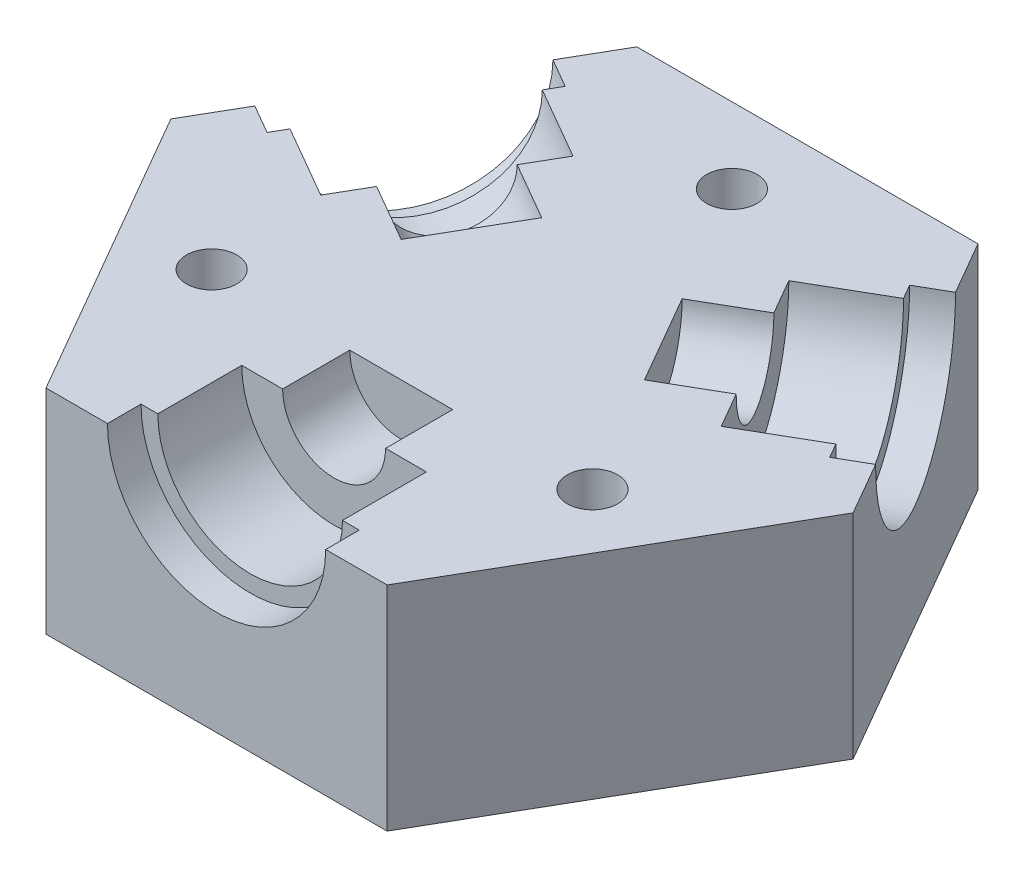
ISO-10303-21;
HEADER;
FILE_DESCRIPTION(('STEP AP214'),'2;1');
FILE_NAME('part.step','',(''),(''),'','','');
FILE_SCHEMA(('AUTOMOTIVE_DESIGN { 1 0 10303 214 1 1 1 1 }'));
ENDSEC;
DATA;
#1=APPLICATION_CONTEXT('core data for automotive mechanical design processes');
#2=APPLICATION_PROTOCOL_DEFINITION('international standard','automotive_design',2000,#1);
#3=PRODUCT_CONTEXT('',#1,'mechanical');
#4=PRODUCT('Part','Part','',(#3));
#5=PRODUCT_RELATED_PRODUCT_CATEGORY('part','',(#4));
#6=PRODUCT_DEFINITION_FORMATION('','',#4);
#7=PRODUCT_DEFINITION_CONTEXT('part definition',#1,'design');
#8=PRODUCT_DEFINITION('design','',#6,#7);
#9=PRODUCT_DEFINITION_SHAPE('','',#8);
#10=(LENGTH_UNIT() NAMED_UNIT(*) SI_UNIT(.MILLI.,.METRE.));
#11=(NAMED_UNIT(*) PLANE_ANGLE_UNIT() SI_UNIT($,.RADIAN.));
#12=(NAMED_UNIT(*) SI_UNIT($,.STERADIAN.) SOLID_ANGLE_UNIT());
#13=UNCERTAINTY_MEASURE_WITH_UNIT(LENGTH_MEASURE(1.E-05),#10,'distance_accuracy_value','');
#14=(GEOMETRIC_REPRESENTATION_CONTEXT(3) GLOBAL_UNCERTAINTY_ASSIGNED_CONTEXT((#13)) GLOBAL_UNIT_ASSIGNED_CONTEXT((#10,
#11,#12)) REPRESENTATION_CONTEXT('',''));
#15=CARTESIAN_POINT('',(0.,0.,0.));
#16=DIRECTION('',(0.,0.,1.));
#17=DIRECTION('',(1.,0.,0.));
#18=AXIS2_PLACEMENT_3D('',#15,#16,#17);
#19=CARTESIAN_POINT('',(0.,12.7,0.));
#20=DIRECTION('',(0.,1.,0.));
#21=DIRECTION('',(0.,0.,1.));
#22=AXIS2_PLACEMENT_3D('',#19,#20,#21);
#23=PLANE('',#22);
#24=CARTESIAN_POINT('',(0.,12.7,-13.0976362048998));
#25=DIRECTION('',(0.,1.,0.));
#26=DIRECTION('',(0.,0.,1.));
#27=AXIS2_PLACEMENT_3D('',#24,#25,#26);
#28=CIRCLE('',#27,1.5);
#29=CARTESIAN_POINT('',(0.,12.7,-11.5976362048998));
#30=VERTEX_POINT('',#29);
#31=EDGE_CURVE('E744',#30,#30,#28,.T.);
#32=ORIENTED_EDGE('',*,*,#31,.F.);
#33=EDGE_LOOP('',(#32));
#34=FACE_BOUND('',#33,.T.);
#35=CARTESIAN_POINT('',(11.3428856829709,12.7,6.54881810245048));
#36=DIRECTION('',(0.,1.,0.));
#37=DIRECTION('',(0.,0.,1.));
#38=AXIS2_PLACEMENT_3D('',#35,#36,#37);
#39=CIRCLE('',#38,1.49999999999968);
#40=CARTESIAN_POINT('',(11.3428856829709,12.7,8.04881810245016));
#41=VERTEX_POINT('',#40);
#42=EDGE_CURVE('E747',#41,#41,#39,.T.);
#43=ORIENTED_EDGE('',*,*,#42,.F.);
#44=EDGE_LOOP('',(#43));
#45=FACE_BOUND('',#44,.T.);
#46=CARTESIAN_POINT('',(-11.3428856829701,12.7,6.54881810245091));
#47=DIRECTION('',(0.,1.,0.));
#48=DIRECTION('',(0.,0.,1.));
#49=AXIS2_PLACEMENT_3D('',#46,#47,#48);
#50=CIRCLE('',#49,1.50000000000075);
#51=CARTESIAN_POINT('',(-11.3428856829701,12.7,8.04881810245166));
#52=VERTEX_POINT('',#51);
#53=EDGE_CURVE('E755',#52,#52,#50,.T.);
#54=ORIENTED_EDGE('',*,*,#53,.F.);
#55=EDGE_LOOP('',(#54));
#56=FACE_BOUND('',#55,.T.);
#57=DIRECTION('',(-0.5,0.,0.866025403784439));
#58=VECTOR('',#57,1.);
#59=CARTESIAN_POINT('',(-10.16,12.7,-17.5976362048998));
#60=LINE('',#59,#58);
#61=CARTESIAN_POINT('',(-10.16,12.7,-17.5976362048998));
#62=VERTEX_POINT('',#61);
#63=CARTESIAN_POINT('',(-11.9900000000001,12.7,-14.4279832270486));
#64=VERTEX_POINT('',#63);
#65=EDGE_CURVE('E220',#62,#64,#60,.T.);
#66=ORIENTED_EDGE('',*,*,#65,.T.);
#67=DIRECTION('',(-0.866025403784443,0.,-0.499999999999992));
#68=VECTOR('',#67,1.);
#69=CARTESIAN_POINT('',(-11.9900000000001,12.7,-14.4279832270486));
#70=LINE('',#69,#68);
#71=CARTESIAN_POINT('',(-10.2579491924312,12.7,-13.4279832270487));
#72=VERTEX_POINT('',#71);
#73=EDGE_CURVE('E54',#64,#72,#70,.F.);
#74=ORIENTED_EDGE('',*,*,#73,.T.);
#75=DIRECTION('',(-0.499999999999992,0.,0.866025403784443));
#76=VECTOR('',#75,1.);
#77=CARTESIAN_POINT('',(-13.5079491924312,12.7,-7.79881810244977));
#78=LINE('',#77,#76);
#79=CARTESIAN_POINT('',(-10.7579491924312,12.7,-12.5619578232642));
#80=VERTEX_POINT('',#79);
#81=EDGE_CURVE('E11',#72,#80,#78,.T.);
#82=ORIENTED_EDGE('',*,*,#81,.T.);
#83=DIRECTION('',(-0.866025403784443,0.,-0.499999999999992));
#84=VECTOR('',#83,1.);
#85=CARTESIAN_POINT('',(-12.4900000000001,12.7,-13.5619578232642));
#86=LINE('',#85,#84);
#87=CARTESIAN_POINT('',(-6.42782217350903,12.7,-10.0619578232642));
#88=VERTEX_POINT('',#87);
#89=EDGE_CURVE('E41',#80,#88,#86,.F.);
#90=ORIENTED_EDGE('',*,*,#89,.T.);
#91=DIRECTION('',(-0.499999999999992,0.,0.866025403784443));
#92=VECTOR('',#91,1.);
#93=CARTESIAN_POINT('',(-9.17782217350898,12.7,-5.29881810244981));
#94=LINE('',#93,#92);
#95=CARTESIAN_POINT('',(-7.64516692295867,12.7,-7.95345486689021));
#96=VERTEX_POINT('',#95);
#97=EDGE_CURVE('E328',#88,#96,#94,.T.);
#98=ORIENTED_EDGE('',*,*,#97,.T.);
#99=DIRECTION('',(-0.866025403784443,0.,-0.499999999999992));
#100=VECTOR('',#99,1.);
#101=CARTESIAN_POINT('',(-13.7073447494498,12.7,-11.4534548668902));
#102=LINE('',#101,#100);
#103=CARTESIAN_POINT('',(-4.1810653078209,12.7,-5.95345486689024));
#104=VERTEX_POINT('',#103);
#105=EDGE_CURVE('E333',#96,#104,#102,.F.);
#106=ORIENTED_EDGE('',*,*,#105,.T.);
#107=DIRECTION('',(-0.499999999999992,0.,0.866025403784443));
#108=VECTOR('',#107,1.);
#109=CARTESIAN_POINT('',(-5.71372055837121,12.7,-3.29881810244984));
#110=LINE('',#109,#108);
#111=CARTESIAN_POINT('',(-7.24637580892152,12.7,-0.644181338009443));
#112=VERTEX_POINT('',#111);
#113=EDGE_CURVE('E331',#104,#112,#110,.T.);
#114=ORIENTED_EDGE('',*,*,#113,.T.);
#115=DIRECTION('',(-0.866025403784443,0.,-0.499999999999992));
#116=VECTOR('',#115,1.);
#117=CARTESIAN_POINT('',(-16.7726552505504,12.7,-6.14418133800936));
#118=LINE('',#117,#116);
#119=CARTESIAN_POINT('',(-10.7104774240593,12.7,-2.64418133800941));
#120=VERTEX_POINT('',#119);
#121=EDGE_CURVE('E327',#112,#120,#118,.T.);
#122=ORIENTED_EDGE('',*,*,#121,.T.);
#123=CARTESIAN_POINT('',(-11.9278221735089,12.7,-0.535678381635376));
#124=VERTEX_POINT('',#123);
#125=EDGE_CURVE('E324',#120,#124,#94,.T.);
#126=ORIENTED_EDGE('',*,*,#125,.T.);
#127=DIRECTION('',(-0.866025403784443,0.,-0.499999999999992));
#128=VECTOR('',#127,1.);
#129=CARTESIAN_POINT('',(-17.99,12.7,-4.03567838163532));
#130=LINE('',#129,#128);
#131=CARTESIAN_POINT('',(-16.2579491924312,12.7,-3.03567838163533));
#132=VERTEX_POINT('',#131);
#133=EDGE_CURVE('E322',#124,#132,#130,.T.);
#134=ORIENTED_EDGE('',*,*,#133,.T.);
#135=CARTESIAN_POINT('',(-16.7579491924311,12.7,-2.16965297785089));
#136=VERTEX_POINT('',#135);
#137=EDGE_CURVE('E47',#132,#136,#78,.T.);
#138=ORIENTED_EDGE('',*,*,#137,.T.);
#139=DIRECTION('',(-0.866025403784443,0.,-0.499999999999992));
#140=VECTOR('',#139,1.);
#141=CARTESIAN_POINT('',(-18.49,12.7,-3.16965297785088));
#142=LINE('',#141,#140);
#143=CARTESIAN_POINT('',(-18.49,12.7,-3.16965297785088));
#144=VERTEX_POINT('',#143);
#145=EDGE_CURVE('E202',#136,#144,#142,.T.);
#146=ORIENTED_EDGE('',*,*,#145,.T.);
#147=CARTESIAN_POINT('',(-20.32,12.7,0.));
#148=VERTEX_POINT('',#147);
#149=EDGE_CURVE('E211',#144,#148,#60,.T.);
#150=ORIENTED_EDGE('',*,*,#149,.T.);
#151=DIRECTION('',(0.5,0.,0.866025403784439));
#152=VECTOR('',#151,1.);
#153=CARTESIAN_POINT('',(-20.32,12.7,0.));
#154=LINE('',#153,#152);
#155=CARTESIAN_POINT('',(-10.16,12.7,17.5976362048998));
#156=VERTEX_POINT('',#155);
#157=EDGE_CURVE('E223',#148,#156,#154,.T.);
#158=ORIENTED_EDGE('',*,*,#157,.T.);
#159=DIRECTION('',(1.,0.,0.));
#160=VECTOR('',#159,1.);
#161=CARTESIAN_POINT('',(-10.16,12.7,17.5976362048998));
#162=LINE('',#161,#160);
#163=CARTESIAN_POINT('',(-6.5,12.7,17.5976362048998));
#164=VERTEX_POINT('',#163);
#165=EDGE_CURVE('E231',#156,#164,#162,.T.);
#166=ORIENTED_EDGE('',*,*,#165,.T.);
#167=DIRECTION('',(0.,0.,1.));
#168=VECTOR('',#167,1.);
#169=CARTESIAN_POINT('',(-6.5,12.7,17.5976362048998));
#170=LINE('',#169,#168);
#171=CARTESIAN_POINT('',(-6.5,12.7,15.5976362048998));
#172=VERTEX_POINT('',#171);
#173=EDGE_CURVE('E295',#164,#172,#170,.F.);
#174=ORIENTED_EDGE('',*,*,#173,.T.);
#175=DIRECTION('',(1.,0.,0.));
#176=VECTOR('',#175,1.);
#177=CARTESIAN_POINT('',(0.,12.7,15.5976362048998));
#178=LINE('',#177,#176);
#179=CARTESIAN_POINT('',(-5.5,12.7,15.5976362048998));
#180=VERTEX_POINT('',#179);
#181=EDGE_CURVE('E276',#172,#180,#178,.T.);
#182=ORIENTED_EDGE('',*,*,#181,.T.);
#183=DIRECTION('',(0.,0.,1.));
#184=VECTOR('',#183,1.);
#185=CARTESIAN_POINT('',(-5.5,12.7,17.5976362048998));
#186=LINE('',#185,#184);
#187=CARTESIAN_POINT('',(-5.5,12.7,10.5976362048998));
#188=VERTEX_POINT('',#187);
#189=EDGE_CURVE('E292',#180,#188,#186,.F.);
#190=ORIENTED_EDGE('',*,*,#189,.T.);
#191=DIRECTION('',(1.,0.,0.));
#192=VECTOR('',#191,1.);
#193=CARTESIAN_POINT('',(0.,12.7,10.5976362048998));
#194=LINE('',#193,#192);
#195=CARTESIAN_POINT('',(-3.06531050110067,12.7,10.5976362048998));
#196=VERTEX_POINT('',#195);
#197=EDGE_CURVE('E283',#188,#196,#194,.T.);
#198=ORIENTED_EDGE('',*,*,#197,.T.);
#199=DIRECTION('',(0.,0.,1.));
#200=VECTOR('',#199,1.);
#201=CARTESIAN_POINT('',(-3.06531050110067,12.7,17.5976362048998));
#202=LINE('',#201,#200);
#203=CARTESIAN_POINT('',(-3.06531050110067,12.7,6.59763620489979));
#204=VERTEX_POINT('',#203);
#205=EDGE_CURVE('E289',#196,#204,#202,.F.);
#206=ORIENTED_EDGE('',*,*,#205,.T.);
#207=DIRECTION('',(1.,0.,0.));
#208=VECTOR('',#207,1.);
#209=CARTESIAN_POINT('',(0.,12.7,6.59763620489979));
#210=LINE('',#209,#208);
#211=CARTESIAN_POINT('',(3.06531050110067,12.7,6.59763620489979));
#212=VERTEX_POINT('',#211);
#213=EDGE_CURVE('E286',#204,#212,#210,.T.);
#214=ORIENTED_EDGE('',*,*,#213,.T.);
#215=DIRECTION('',(0.,0.,1.));
#216=VECTOR('',#215,1.);
#217=CARTESIAN_POINT('',(3.06531050110067,12.7,17.5976362048998));
#218=LINE('',#217,#216);
#219=CARTESIAN_POINT('',(3.06531050110067,12.7,10.5976362048998));
#220=VERTEX_POINT('',#219);
#221=EDGE_CURVE('E282',#212,#220,#218,.T.);
#222=ORIENTED_EDGE('',*,*,#221,.T.);
#223=CARTESIAN_POINT('',(5.5,12.7,10.5976362048998));
#224=VERTEX_POINT('',#223);
#225=EDGE_CURVE('E279',#220,#224,#194,.T.);
#226=ORIENTED_EDGE('',*,*,#225,.T.);
#227=DIRECTION('',(0.,0.,1.));
#228=VECTOR('',#227,1.);
#229=CARTESIAN_POINT('',(5.5,12.7,17.5976362048998));
#230=LINE('',#229,#228);
#231=CARTESIAN_POINT('',(5.5,12.7,15.5976362048998));
#232=VERTEX_POINT('',#231);
#233=EDGE_CURVE('E275',#224,#232,#230,.T.);
#234=ORIENTED_EDGE('',*,*,#233,.T.);
#235=CARTESIAN_POINT('',(6.5,12.7,15.5976362048998));
#236=VERTEX_POINT('',#235);
#237=EDGE_CURVE('E272',#232,#236,#178,.T.);
#238=ORIENTED_EDGE('',*,*,#237,.T.);
#239=DIRECTION('',(0.,0.,1.));
#240=VECTOR('',#239,1.);
#241=CARTESIAN_POINT('',(6.5,12.7,17.5976362048998));
#242=LINE('',#241,#240);
#243=CARTESIAN_POINT('',(6.5,12.7,17.5976362048998));
#244=VERTEX_POINT('',#243);
#245=EDGE_CURVE('E269',#236,#244,#242,.T.);
#246=ORIENTED_EDGE('',*,*,#245,.T.);
#247=CARTESIAN_POINT('',(10.16,12.7,17.5976362048998));
#248=VERTEX_POINT('',#247);
#249=EDGE_CURVE('E230',#244,#248,#162,.T.);
#250=ORIENTED_EDGE('',*,*,#249,.T.);
#251=DIRECTION('',(0.5,0.,-0.866025403784439));
#252=VECTOR('',#251,1.);
#253=CARTESIAN_POINT('',(10.16,12.7,17.5976362048998));
#254=LINE('',#253,#252);
#255=CARTESIAN_POINT('',(20.32,12.7,0.));
#256=VERTEX_POINT('',#255);
#257=EDGE_CURVE('E234',#248,#256,#254,.T.);
#258=ORIENTED_EDGE('',*,*,#257,.T.);
#259=DIRECTION('',(-0.5,0.,-0.866025403784439));
#260=VECTOR('',#259,1.);
#261=CARTESIAN_POINT('',(20.32,12.7,0.));
#262=LINE('',#261,#260);
#263=CARTESIAN_POINT('',(18.49,12.7,-3.16965297785112));
#264=VERTEX_POINT('',#263);
#265=EDGE_CURVE('E237',#256,#264,#262,.T.);
#266=ORIENTED_EDGE('',*,*,#265,.T.);
#267=DIRECTION('',(0.866025403784436,0.,-0.500000000000004));
#268=VECTOR('',#267,1.);
#269=CARTESIAN_POINT('',(18.49,12.7,-3.16965297785114));
#270=LINE('',#269,#268);
#271=CARTESIAN_POINT('',(16.7579491924311,12.7,-2.16965297785113));
#272=VERTEX_POINT('',#271);
#273=EDGE_CURVE('E62',#264,#272,#270,.F.);
#274=ORIENTED_EDGE('',*,*,#273,.T.);
#275=DIRECTION('',(-0.500000000000004,0.,-0.866025403784436));
#276=VECTOR('',#275,1.);
#277=CARTESIAN_POINT('',(13.5079491924311,12.7,-7.79881810244996));
#278=LINE('',#277,#276);
#279=CARTESIAN_POINT('',(16.2579491924311,12.7,-3.03567838163556));
#280=VERTEX_POINT('',#279);
#281=EDGE_CURVE('E207',#272,#280,#278,.T.);
#282=ORIENTED_EDGE('',*,*,#281,.T.);
#283=DIRECTION('',(0.866025403784436,0.,-0.500000000000004));
#284=VECTOR('',#283,1.);
#285=CARTESIAN_POINT('',(17.99,12.7,-4.03567838163557));
#286=LINE('',#285,#284);
#287=CARTESIAN_POINT('',(11.9278221735089,12.7,-0.535678381635539));
#288=VERTEX_POINT('',#287);
#289=EDGE_CURVE('E319',#280,#288,#286,.F.);
#290=ORIENTED_EDGE('',*,*,#289,.T.);
#291=DIRECTION('',(-0.500000000000004,0.,-0.866025403784436));
#292=VECTOR('',#291,1.);
#293=CARTESIAN_POINT('',(9.17782217350891,12.7,-5.29881810244994));
#294=LINE('',#293,#292);
#295=CARTESIAN_POINT('',(10.7104774240593,12.7,-2.64418133800956));
#296=VERTEX_POINT('',#295);
#297=EDGE_CURVE('E310',#288,#296,#294,.T.);
#298=ORIENTED_EDGE('',*,*,#297,.T.);
#299=DIRECTION('',(0.866025403784436,0.,-0.500000000000004));
#300=VECTOR('',#299,1.);
#301=CARTESIAN_POINT('',(16.7726552505503,12.7,-6.14418133800959));
#302=LINE('',#301,#300);
#303=CARTESIAN_POINT('',(7.24637580892151,12.7,-0.644181338009542));
#304=VERTEX_POINT('',#303);
#305=EDGE_CURVE('E316',#296,#304,#302,.F.);
#306=ORIENTED_EDGE('',*,*,#305,.T.);
#307=DIRECTION('',(-0.500000000000004,0.,-0.866025403784436));
#308=VECTOR('',#307,1.);
#309=CARTESIAN_POINT('',(5.71372055837116,12.7,-3.29881810244992));
#310=LINE('',#309,#308);
#311=CARTESIAN_POINT('',(4.18106530782081,12.7,-5.9534548668903));
#312=VERTEX_POINT('',#311);
#313=EDGE_CURVE('E313',#304,#312,#310,.T.);
#314=ORIENTED_EDGE('',*,*,#313,.T.);
#315=DIRECTION('',(0.866025403784436,0.,-0.500000000000004));
#316=VECTOR('',#315,1.);
#317=CARTESIAN_POINT('',(13.7073447494496,12.7,-11.4534548668904));
#318=LINE('',#317,#316);
#319=CARTESIAN_POINT('',(7.64516692295856,12.7,-7.95345486689032));
#320=VERTEX_POINT('',#319);
#321=EDGE_CURVE('E309',#312,#320,#318,.T.);
#322=ORIENTED_EDGE('',*,*,#321,.T.);
#323=CARTESIAN_POINT('',(6.42782217350889,12.7,-10.0619578232643));
#324=VERTEX_POINT('',#323);
#325=EDGE_CURVE('E306',#320,#324,#294,.T.);
#326=ORIENTED_EDGE('',*,*,#325,.T.);
#327=DIRECTION('',(0.866025403784436,0.,-0.500000000000004));
#328=VECTOR('',#327,1.);
#329=CARTESIAN_POINT('',(12.4899999999999,12.7,-13.5619578232644));
#330=LINE('',#329,#328);
#331=CARTESIAN_POINT('',(10.7579491924311,12.7,-12.5619578232644));
#332=VERTEX_POINT('',#331);
#333=EDGE_CURVE('E303',#324,#332,#330,.T.);
#334=ORIENTED_EDGE('',*,*,#333,.T.);
#335=CARTESIAN_POINT('',(10.2579491924311,12.7,-13.4279832270488));
#336=VERTEX_POINT('',#335);
#337=EDGE_CURVE('E300',#332,#336,#278,.T.);
#338=ORIENTED_EDGE('',*,*,#337,.T.);
#339=DIRECTION('',(0.866025403784436,0.,-0.500000000000004));
#340=VECTOR('',#339,1.);
#341=CARTESIAN_POINT('',(11.9899999999999,12.7,-14.4279832270488));
#342=LINE('',#341,#340);
#343=CARTESIAN_POINT('',(11.9899999999999,12.7,-14.4279832270488));
#344=VERTEX_POINT('',#343);
#345=EDGE_CURVE('E375',#336,#344,#342,.T.);
#346=ORIENTED_EDGE('',*,*,#345,.T.);
#347=CARTESIAN_POINT('',(10.16,12.7,-17.5976362048998));
#348=VERTEX_POINT('',#347);
#349=EDGE_CURVE('E236',#344,#348,#262,.T.);
#350=ORIENTED_EDGE('',*,*,#349,.T.);
#351=DIRECTION('',(-1.,0.,0.));
#352=VECTOR('',#351,1.);
#353=CARTESIAN_POINT('',(10.16,12.7,-17.5976362048998));
#354=LINE('',#353,#352);
#355=EDGE_CURVE('E221',#348,#62,#354,.T.);
#356=ORIENTED_EDGE('',*,*,#355,.T.);
#357=EDGE_LOOP('',(#66,#74,#82,#90,#98,#106,#114,#122,#126,#134,#138,#146,#150,#158,#166,#174,
#182,#190,#198,#206,#214,#222,#226,#234,#238,#246,#250,#258,#266,#274,#282,#290,#298,#306,#314,
#322,#326,#334,#338,#346,#350,#356));
#358=FACE_BOUND('',#357,.T.);
#359=ADVANCED_FACE('F37',(#34,#45,#56,#358),#23,.T.);
#360=CARTESIAN_POINT('',(10.16,12.7,-17.5976362048998));
#361=DIRECTION('',(0.,0.,1.));
#362=DIRECTION('',(1.,0.,0.));
#363=AXIS2_PLACEMENT_3D('',#360,#361,#362);
#364=PLANE('',#363);
#365=DIRECTION('',(-1.,0.,0.));
#366=VECTOR('',#365,1.);
#367=CARTESIAN_POINT('',(10.16,0.,-17.5976362048998));
#368=LINE('',#367,#366);
#369=CARTESIAN_POINT('',(10.16,0.,-17.5976362048998));
#370=VERTEX_POINT('',#369);
#371=CARTESIAN_POINT('',(-10.16,0.,-17.5976362048998));
#372=VERTEX_POINT('',#371);
#373=EDGE_CURVE('E241',#370,#372,#368,.T.);
#374=ORIENTED_EDGE('',*,*,#373,.T.);
#375=DIRECTION('',(0.,-1.,0.));
#376=VECTOR('',#375,1.);
#377=CARTESIAN_POINT('',(-10.16,12.7,-17.5976362048998));
#378=LINE('',#377,#376);
#379=EDGE_CURVE('E266',#62,#372,#378,.T.);
#380=ORIENTED_EDGE('',*,*,#379,.F.);
#381=ORIENTED_EDGE('',*,*,#355,.F.);
#382=DIRECTION('',(0.,-1.,0.));
#383=VECTOR('',#382,1.);
#384=CARTESIAN_POINT('',(10.16,12.7,-17.5976362048998));
#385=LINE('',#384,#383);
#386=EDGE_CURVE('E240',#348,#370,#385,.T.);
#387=ORIENTED_EDGE('',*,*,#386,.T.);
#388=EDGE_LOOP('',(#374,#380,#381,#387));
#389=FACE_BOUND('',#388,.T.);
#390=ADVANCED_FACE('F39',(#389),#364,.F.);
#391=CARTESIAN_POINT('',(-10.16,12.7,-17.5976362048998));
#392=DIRECTION('',(0.866025403784439,0.,0.5));
#393=DIRECTION('',(0.5,0.,-0.866025403784439));
#394=AXIS2_PLACEMENT_3D('',#391,#392,#393);
#395=PLANE('',#394);
#396=CARTESIAN_POINT('',(-15.2400000000001,12.7,-8.79881810244976));
#397=DIRECTION('',(0.866025403784439,0.,0.5));
#398=DIRECTION('',(0.5,0.,-0.866025403784439));
#399=AXIS2_PLACEMENT_3D('',#396,#397,#398);
#400=CIRCLE('',#399,6.5);
#401=EDGE_CURVE('E199',#64,#144,#400,.F.);
#402=ORIENTED_EDGE('',*,*,#401,.F.);
#403=ORIENTED_EDGE('',*,*,#65,.F.);
#404=ORIENTED_EDGE('',*,*,#379,.T.);
#405=DIRECTION('',(-0.5,0.,0.866025403784439));
#406=VECTOR('',#405,1.);
#407=CARTESIAN_POINT('',(-10.16,0.,-17.5976362048998));
#408=LINE('',#407,#406);
#409=CARTESIAN_POINT('',(-20.32,0.,0.));
#410=VERTEX_POINT('',#409);
#411=EDGE_CURVE('E244',#372,#410,#408,.T.);
#412=ORIENTED_EDGE('',*,*,#411,.T.);
#413=DIRECTION('',(0.,-1.,0.));
#414=VECTOR('',#413,1.);
#415=CARTESIAN_POINT('',(-20.32,12.7,0.));
#416=LINE('',#415,#414);
#417=EDGE_CURVE('E218',#148,#410,#416,.T.);
#418=ORIENTED_EDGE('',*,*,#417,.F.);
#419=ORIENTED_EDGE('',*,*,#149,.F.);
#420=EDGE_LOOP('',(#402,#403,#404,#412,#418,#419));
#421=FACE_BOUND('',#420,.T.);
#422=ADVANCED_FACE('F216',(#421),#395,.F.);
#423=CARTESIAN_POINT('',(-20.32,12.7,0.));
#424=DIRECTION('',(0.866025403784439,0.,-0.5));
#425=DIRECTION('',(-0.5,0.,-0.866025403784439));
#426=AXIS2_PLACEMENT_3D('',#423,#424,#425);
#427=PLANE('',#426);
#428=DIRECTION('',(0.5,0.,0.866025403784439));
#429=VECTOR('',#428,1.);
#430=CARTESIAN_POINT('',(-20.32,0.,0.));
#431=LINE('',#430,#429);
#432=CARTESIAN_POINT('',(-10.16,0.,17.5976362048998));
#433=VERTEX_POINT('',#432);
#434=EDGE_CURVE('E247',#410,#433,#431,.T.);
#435=ORIENTED_EDGE('',*,*,#434,.T.);
#436=DIRECTION('',(0.,-1.,0.));
#437=VECTOR('',#436,1.);
#438=CARTESIAN_POINT('',(-10.16,12.7,17.5976362048998));
#439=LINE('',#438,#437);
#440=EDGE_CURVE('E262',#156,#433,#439,.T.);
#441=ORIENTED_EDGE('',*,*,#440,.F.);
#442=ORIENTED_EDGE('',*,*,#157,.F.);
#443=ORIENTED_EDGE('',*,*,#417,.T.);
#444=EDGE_LOOP('',(#435,#441,#442,#443));
#445=FACE_BOUND('',#444,.T.);
#446=ADVANCED_FACE('F476',(#445),#427,.F.);
#447=CARTESIAN_POINT('',(-10.16,12.7,17.5976362048998));
#448=DIRECTION('',(0.,0.,-1.));
#449=DIRECTION('',(-1.,0.,0.));
#450=AXIS2_PLACEMENT_3D('',#447,#448,#449);
#451=PLANE('',#450);
#452=CARTESIAN_POINT('',(0.,12.7,17.5976362048998));
#453=DIRECTION('',(0.,0.,1.));
#454=DIRECTION('',(1.,0.,0.));
#455=AXIS2_PLACEMENT_3D('',#452,#453,#454);
#456=CIRCLE('',#455,6.5);
#457=EDGE_CURVE('E379',#164,#244,#456,.T.);
#458=ORIENTED_EDGE('',*,*,#457,.F.);
#459=ORIENTED_EDGE('',*,*,#165,.F.);
#460=ORIENTED_EDGE('',*,*,#440,.T.);
#461=DIRECTION('',(1.,0.,0.));
#462=VECTOR('',#461,1.);
#463=CARTESIAN_POINT('',(-10.16,0.,17.5976362048998));
#464=LINE('',#463,#462);
#465=CARTESIAN_POINT('',(10.16,0.,17.5976362048998));
#466=VERTEX_POINT('',#465);
#467=EDGE_CURVE('E249',#433,#466,#464,.T.);
#468=ORIENTED_EDGE('',*,*,#467,.T.);
#469=DIRECTION('',(0.,-1.,0.));
#470=VECTOR('',#469,1.);
#471=CARTESIAN_POINT('',(10.16,12.7,17.5976362048998));
#472=LINE('',#471,#470);
#473=EDGE_CURVE('E259',#248,#466,#472,.T.);
#474=ORIENTED_EDGE('',*,*,#473,.F.);
#475=ORIENTED_EDGE('',*,*,#249,.F.);
#476=EDGE_LOOP('',(#458,#459,#460,#468,#474,#475));
#477=FACE_BOUND('',#476,.T.);
#478=ADVANCED_FACE('F416',(#477),#451,.F.);
#479=CARTESIAN_POINT('',(10.16,12.7,17.5976362048998));
#480=DIRECTION('',(-0.866025403784439,0.,-0.5));
#481=DIRECTION('',(-0.5,0.,0.866025403784439));
#482=AXIS2_PLACEMENT_3D('',#479,#480,#481);
#483=PLANE('',#482);
#484=DIRECTION('',(0.5,0.,-0.866025403784439));
#485=VECTOR('',#484,1.);
#486=CARTESIAN_POINT('',(10.16,0.,17.5976362048998));
#487=LINE('',#486,#485);
#488=CARTESIAN_POINT('',(20.32,0.,0.));
#489=VERTEX_POINT('',#488);
#490=EDGE_CURVE('E251',#466,#489,#487,.T.);
#491=ORIENTED_EDGE('',*,*,#490,.T.);
#492=DIRECTION('',(0.,-1.,0.));
#493=VECTOR('',#492,1.);
#494=CARTESIAN_POINT('',(20.32,12.7,0.));
#495=LINE('',#494,#493);
#496=EDGE_CURVE('E256',#256,#489,#495,.T.);
#497=ORIENTED_EDGE('',*,*,#496,.F.);
#498=ORIENTED_EDGE('',*,*,#257,.F.);
#499=ORIENTED_EDGE('',*,*,#473,.T.);
#500=EDGE_LOOP('',(#491,#497,#498,#499));
#501=FACE_BOUND('',#500,.T.);
#502=ADVANCED_FACE('F422',(#501),#483,.F.);
#503=CARTESIAN_POINT('',(20.32,12.7,0.));
#504=DIRECTION('',(-0.866025403784439,0.,0.5));
#505=DIRECTION('',(0.5,0.,0.866025403784439));
#506=AXIS2_PLACEMENT_3D('',#503,#504,#505);
#507=PLANE('',#506);
#508=CARTESIAN_POINT('',(15.24,12.7,-8.79881810244997));
#509=DIRECTION('',(-0.866025403784439,0.,0.5));
#510=DIRECTION('',(0.5,0.,0.866025403784439));
#511=AXIS2_PLACEMENT_3D('',#508,#509,#510);
#512=CIRCLE('',#511,6.5);
#513=EDGE_CURVE('E298',#264,#344,#512,.F.);
#514=ORIENTED_EDGE('',*,*,#513,.F.);
#515=ORIENTED_EDGE('',*,*,#265,.F.);
#516=ORIENTED_EDGE('',*,*,#496,.T.);
#517=DIRECTION('',(-0.5,0.,-0.866025403784439));
#518=VECTOR('',#517,1.);
#519=CARTESIAN_POINT('',(20.32,0.,0.));
#520=LINE('',#519,#518);
#521=EDGE_CURVE('E225',#489,#370,#520,.T.);
#522=ORIENTED_EDGE('',*,*,#521,.T.);
#523=ORIENTED_EDGE('',*,*,#386,.F.);
#524=ORIENTED_EDGE('',*,*,#349,.F.);
#525=EDGE_LOOP('',(#514,#515,#516,#522,#523,#524));
#526=FACE_BOUND('',#525,.T.);
#527=ADVANCED_FACE('F426',(#526),#507,.F.);
#528=CARTESIAN_POINT('',(0.,0.,0.));
#529=DIRECTION('',(0.,1.,0.));
#530=DIRECTION('',(0.,0.,1.));
#531=AXIS2_PLACEMENT_3D('',#528,#529,#530);
#532=PLANE('',#531);
#533=ORIENTED_EDGE('',*,*,#373,.F.);
#534=ORIENTED_EDGE('',*,*,#521,.F.);
#535=ORIENTED_EDGE('',*,*,#490,.F.);
#536=ORIENTED_EDGE('',*,*,#467,.F.);
#537=ORIENTED_EDGE('',*,*,#434,.F.);
#538=ORIENTED_EDGE('',*,*,#411,.F.);
#539=EDGE_LOOP('',(#533,#534,#535,#536,#537,#538));
#540=FACE_BOUND('',#539,.T.);
#541=ADVANCED_FACE('F466',(#540),#532,.F.);
#542=CARTESIAN_POINT('',(0.,12.7,6.59763620489979));
#543=DIRECTION('',(0.,0.,1.));
#544=DIRECTION('',(1.,0.,0.));
#545=AXIS2_PLACEMENT_3D('',#542,#543,#544);
#546=PLANE('',#545);
#547=CARTESIAN_POINT('',(0.,12.7,6.59763620489979));
#548=DIRECTION('',(0.,0.,1.));
#549=DIRECTION('',(1.,0.,0.));
#550=AXIS2_PLACEMENT_3D('',#547,#548,#549);
#551=CIRCLE('',#550,3.06531050110067);
#552=EDGE_CURVE('E245',#204,#212,#551,.T.);
#553=ORIENTED_EDGE('',*,*,#552,.T.);
#554=ORIENTED_EDGE('',*,*,#213,.F.);
#555=EDGE_LOOP('',(#553,#554));
#556=FACE_BOUND('',#555,.T.);
#557=ADVANCED_FACE('F395',(#556),#546,.T.);
#558=CARTESIAN_POINT('',(0.,12.7,17.5976362048998));
#559=DIRECTION('',(0.,0.,1.));
#560=DIRECTION('',(1.,0.,0.));
#561=AXIS2_PLACEMENT_3D('',#558,#559,#560);
#562=CYLINDRICAL_SURFACE('',#561,3.06531050110067);
#563=CARTESIAN_POINT('',(0.,12.7,10.5976362048998));
#564=DIRECTION('',(0.,0.,1.));
#565=DIRECTION('',(1.,0.,0.));
#566=AXIS2_PLACEMENT_3D('',#563,#564,#565);
#567=CIRCLE('',#566,3.06531050110067);
#568=EDGE_CURVE('E390',#196,#220,#567,.T.);
#569=ORIENTED_EDGE('',*,*,#568,.T.);
#570=ORIENTED_EDGE('',*,*,#221,.F.);
#571=ORIENTED_EDGE('',*,*,#552,.F.);
#572=ORIENTED_EDGE('',*,*,#205,.F.);
#573=EDGE_LOOP('',(#569,#570,#571,#572));
#574=FACE_BOUND('',#573,.T.);
#575=ADVANCED_FACE('F399',(#574),#562,.F.);
#576=CARTESIAN_POINT('',(-3.06531050110067,12.7,10.5976362048998));
#577=DIRECTION('',(0.,0.,1.));
#578=DIRECTION('',(1.,0.,0.));
#579=AXIS2_PLACEMENT_3D('',#576,#577,#578);
#580=PLANE('',#579);
#581=CARTESIAN_POINT('',(0.,12.7,10.5976362048998));
#582=DIRECTION('',(0.,0.,1.));
#583=DIRECTION('',(1.,0.,0.));
#584=AXIS2_PLACEMENT_3D('',#581,#582,#583);
#585=CIRCLE('',#584,5.5);
#586=EDGE_CURVE('E387',#188,#224,#585,.T.);
#587=ORIENTED_EDGE('',*,*,#586,.T.);
#588=ORIENTED_EDGE('',*,*,#225,.F.);
#589=ORIENTED_EDGE('',*,*,#568,.F.);
#590=ORIENTED_EDGE('',*,*,#197,.F.);
#591=EDGE_LOOP('',(#587,#588,#589,#590));
#592=FACE_BOUND('',#591,.T.);
#593=ADVANCED_FACE('F401',(#592),#580,.T.);
#594=CARTESIAN_POINT('',(0.,12.7,17.5976362048998));
#595=DIRECTION('',(0.,0.,1.));
#596=DIRECTION('',(1.,0.,0.));
#597=AXIS2_PLACEMENT_3D('',#594,#595,#596);
#598=CYLINDRICAL_SURFACE('',#597,5.5);
#599=CARTESIAN_POINT('',(0.,12.7,15.5976362048998));
#600=DIRECTION('',(0.,0.,1.));
#601=DIRECTION('',(1.,0.,0.));
#602=AXIS2_PLACEMENT_3D('',#599,#600,#601);
#603=CIRCLE('',#602,5.5);
#604=EDGE_CURVE('E384',#180,#232,#603,.T.);
#605=ORIENTED_EDGE('',*,*,#604,.T.);
#606=ORIENTED_EDGE('',*,*,#233,.F.);
#607=ORIENTED_EDGE('',*,*,#586,.F.);
#608=ORIENTED_EDGE('',*,*,#189,.F.);
#609=EDGE_LOOP('',(#605,#606,#607,#608));
#610=FACE_BOUND('',#609,.T.);
#611=ADVANCED_FACE('F404',(#610),#598,.F.);
#612=CARTESIAN_POINT('',(-5.5,12.7,15.5976362048998));
#613=DIRECTION('',(0.,0.,1.));
#614=DIRECTION('',(1.,0.,0.));
#615=AXIS2_PLACEMENT_3D('',#612,#613,#614);
#616=PLANE('',#615);
#617=CARTESIAN_POINT('',(0.,12.7,15.5976362048998));
#618=DIRECTION('',(0.,0.,1.));
#619=DIRECTION('',(1.,0.,0.));
#620=AXIS2_PLACEMENT_3D('',#617,#618,#619);
#621=CIRCLE('',#620,6.5);
#622=EDGE_CURVE('E381',#172,#236,#621,.T.);
#623=ORIENTED_EDGE('',*,*,#622,.T.);
#624=ORIENTED_EDGE('',*,*,#237,.F.);
#625=ORIENTED_EDGE('',*,*,#604,.F.);
#626=ORIENTED_EDGE('',*,*,#181,.F.);
#627=EDGE_LOOP('',(#623,#624,#625,#626));
#628=FACE_BOUND('',#627,.T.);
#629=ADVANCED_FACE('F408',(#628),#616,.T.);
#630=CARTESIAN_POINT('',(0.,12.7,17.5976362048998));
#631=DIRECTION('',(0.,0.,1.));
#632=DIRECTION('',(1.,0.,0.));
#633=AXIS2_PLACEMENT_3D('',#630,#631,#632);
#634=CYLINDRICAL_SURFACE('',#633,6.5);
#635=ORIENTED_EDGE('',*,*,#457,.T.);
#636=ORIENTED_EDGE('',*,*,#245,.F.);
#637=ORIENTED_EDGE('',*,*,#622,.F.);
#638=ORIENTED_EDGE('',*,*,#173,.F.);
#639=EDGE_LOOP('',(#635,#636,#637,#638));
#640=FACE_BOUND('',#639,.T.);
#641=ADVANCED_FACE('F413',(#640),#634,.F.);
#642=CARTESIAN_POINT('',(5.71372055837116,12.7,-3.29881810244992));
#643=DIRECTION('',(0.866025403784436,0.,-0.500000000000004));
#644=DIRECTION('',(-0.500000000000004,0.,-0.866025403784436));
#645=AXIS2_PLACEMENT_3D('',#642,#643,#644);
#646=PLANE('',#645);
#647=CARTESIAN_POINT('',(5.71372055837116,12.7,-3.29881810244992));
#648=DIRECTION('',(0.866025403784436,0.,-0.500000000000004));
#649=DIRECTION('',(-0.500000000000004,0.,-0.866025403784436));
#650=AXIS2_PLACEMENT_3D('',#647,#648,#649);
#651=CIRCLE('',#650,3.06531050110067);
#652=EDGE_CURVE('E372',#304,#312,#651,.T.);
#653=ORIENTED_EDGE('',*,*,#652,.T.);
#654=ORIENTED_EDGE('',*,*,#313,.F.);
#655=EDGE_LOOP('',(#653,#654));
#656=FACE_BOUND('',#655,.T.);
#657=ADVANCED_FACE('F445',(#656),#646,.T.);
#658=CARTESIAN_POINT('',(15.24,12.7,-8.79881810244997));
#659=DIRECTION('',(0.866025403784436,0.,-0.500000000000004));
#660=DIRECTION('',(-0.500000000000004,0.,-0.866025403784436));
#661=AXIS2_PLACEMENT_3D('',#658,#659,#660);
#662=CYLINDRICAL_SURFACE('',#661,3.06531050110067);
#663=CARTESIAN_POINT('',(9.17782217350891,12.7,-5.29881810244994));
#664=DIRECTION('',(0.866025403784436,0.,-0.500000000000004));
#665=DIRECTION('',(-0.500000000000004,0.,-0.866025403784436));
#666=AXIS2_PLACEMENT_3D('',#663,#664,#665);
#667=CIRCLE('',#666,3.06531050110067);
#668=EDGE_CURVE('E369',#296,#320,#667,.T.);
#669=ORIENTED_EDGE('',*,*,#668,.T.);
#670=ORIENTED_EDGE('',*,*,#321,.F.);
#671=ORIENTED_EDGE('',*,*,#652,.F.);
#672=ORIENTED_EDGE('',*,*,#305,.F.);
#673=EDGE_LOOP('',(#669,#670,#671,#672));
#674=FACE_BOUND('',#673,.T.);
#675=ADVANCED_FACE('F442',(#674),#662,.F.);
#676=CARTESIAN_POINT('',(10.7104774240593,12.7,-2.64418133800956));
#677=DIRECTION('',(0.866025403784436,0.,-0.500000000000004));
#678=DIRECTION('',(-0.500000000000004,0.,-0.866025403784436));
#679=AXIS2_PLACEMENT_3D('',#676,#677,#678);
#680=PLANE('',#679);
#681=CARTESIAN_POINT('',(9.17782217350891,12.7,-5.29881810244994));
#682=DIRECTION('',(0.866025403784436,0.,-0.500000000000004));
#683=DIRECTION('',(-0.500000000000004,0.,-0.866025403784436));
#684=AXIS2_PLACEMENT_3D('',#681,#682,#683);
#685=CIRCLE('',#684,5.5);
#686=EDGE_CURVE('E366',#288,#324,#685,.T.);
#687=ORIENTED_EDGE('',*,*,#686,.T.);
#688=ORIENTED_EDGE('',*,*,#325,.F.);
#689=ORIENTED_EDGE('',*,*,#668,.F.);
#690=ORIENTED_EDGE('',*,*,#297,.F.);
#691=EDGE_LOOP('',(#687,#688,#689,#690));
#692=FACE_BOUND('',#691,.T.);
#693=ADVANCED_FACE('F440',(#692),#680,.T.);
#694=CARTESIAN_POINT('',(15.24,12.7,-8.79881810244997));
#695=DIRECTION('',(0.866025403784436,0.,-0.500000000000004));
#696=DIRECTION('',(-0.500000000000004,0.,-0.866025403784436));
#697=AXIS2_PLACEMENT_3D('',#694,#695,#696);
#698=CYLINDRICAL_SURFACE('',#697,5.5);
#699=CARTESIAN_POINT('',(13.5079491924311,12.7,-7.79881810244996));
#700=DIRECTION('',(0.866025403784436,0.,-0.500000000000004));
#701=DIRECTION('',(-0.500000000000004,0.,-0.866025403784436));
#702=AXIS2_PLACEMENT_3D('',#699,#700,#701);
#703=CIRCLE('',#702,5.5);
#704=EDGE_CURVE('E363',#280,#332,#703,.T.);
#705=ORIENTED_EDGE('',*,*,#704,.T.);
#706=ORIENTED_EDGE('',*,*,#333,.F.);
#707=ORIENTED_EDGE('',*,*,#686,.F.);
#708=ORIENTED_EDGE('',*,*,#289,.F.);
#709=EDGE_LOOP('',(#705,#706,#707,#708));
#710=FACE_BOUND('',#709,.T.);
#711=ADVANCED_FACE('F435',(#710),#698,.F.);
#712=CARTESIAN_POINT('',(16.2579491924311,12.7,-3.03567838163556));
#713=DIRECTION('',(0.866025403784436,0.,-0.500000000000004));
#714=DIRECTION('',(-0.500000000000004,0.,-0.866025403784436));
#715=AXIS2_PLACEMENT_3D('',#712,#713,#714);
#716=PLANE('',#715);
#717=CARTESIAN_POINT('',(13.5079491924311,12.7,-7.79881810244996));
#718=DIRECTION('',(0.866025403784436,0.,-0.500000000000004));
#719=DIRECTION('',(-0.500000000000004,0.,-0.866025403784436));
#720=AXIS2_PLACEMENT_3D('',#717,#718,#719);
#721=CIRCLE('',#720,6.5);
#722=EDGE_CURVE('E360',#272,#336,#721,.T.);
#723=ORIENTED_EDGE('',*,*,#722,.T.);
#724=ORIENTED_EDGE('',*,*,#337,.F.);
#725=ORIENTED_EDGE('',*,*,#704,.F.);
#726=ORIENTED_EDGE('',*,*,#281,.F.);
#727=EDGE_LOOP('',(#723,#724,#725,#726));
#728=FACE_BOUND('',#727,.T.);
#729=ADVANCED_FACE('F432',(#728),#716,.T.);
#730=CARTESIAN_POINT('',(15.24,12.7,-8.79881810244997));
#731=DIRECTION('',(0.866025403784436,0.,-0.500000000000004));
#732=DIRECTION('',(-0.500000000000004,0.,-0.866025403784436));
#733=AXIS2_PLACEMENT_3D('',#730,#731,#732);
#734=CYLINDRICAL_SURFACE('',#733,6.5);
#735=ORIENTED_EDGE('',*,*,#513,.T.);
#736=ORIENTED_EDGE('',*,*,#345,.F.);
#737=ORIENTED_EDGE('',*,*,#722,.F.);
#738=ORIENTED_EDGE('',*,*,#273,.F.);
#739=EDGE_LOOP('',(#735,#736,#737,#738));
#740=FACE_BOUND('',#739,.T.);
#741=ADVANCED_FACE('F429',(#740),#734,.F.);
#742=CARTESIAN_POINT('',(-5.71372055837121,12.7,-3.29881810244984));
#743=DIRECTION('',(-0.866025403784443,0.,-0.499999999999992));
#744=DIRECTION('',(-0.499999999999992,0.,0.866025403784443));
#745=AXIS2_PLACEMENT_3D('',#742,#743,#744);
#746=PLANE('',#745);
#747=CARTESIAN_POINT('',(-5.71372055837121,12.7,-3.29881810244984));
#748=DIRECTION('',(-0.866025403784443,0.,-0.499999999999992));
#749=DIRECTION('',(-0.499999999999992,0.,0.866025403784443));
#750=AXIS2_PLACEMENT_3D('',#747,#748,#749);
#751=CIRCLE('',#750,3.06531050110067);
#752=EDGE_CURVE('E214',#104,#112,#751,.T.);
#753=ORIENTED_EDGE('',*,*,#752,.T.);
#754=ORIENTED_EDGE('',*,*,#113,.F.);
#755=EDGE_LOOP('',(#753,#754));
#756=FACE_BOUND('',#755,.T.);
#757=ADVANCED_FACE('F597',(#756),#746,.T.);
#758=CARTESIAN_POINT('',(-15.2400000000001,12.7,-8.79881810244976));
#759=DIRECTION('',(-0.866025403784443,0.,-0.499999999999992));
#760=DIRECTION('',(-0.499999999999992,0.,0.866025403784443));
#761=AXIS2_PLACEMENT_3D('',#758,#759,#760);
#762=CYLINDRICAL_SURFACE('',#761,3.06531050110067);
#763=CARTESIAN_POINT('',(-9.17782217350898,12.7,-5.29881810244981));
#764=DIRECTION('',(-0.866025403784443,0.,-0.499999999999992));
#765=DIRECTION('',(-0.499999999999992,0.,0.866025403784443));
#766=AXIS2_PLACEMENT_3D('',#763,#764,#765);
#767=CIRCLE('',#766,3.06531050110067);
#768=EDGE_CURVE('E349',#96,#120,#767,.T.);
#769=ORIENTED_EDGE('',*,*,#768,.T.);
#770=ORIENTED_EDGE('',*,*,#121,.F.);
#771=ORIENTED_EDGE('',*,*,#752,.F.);
#772=ORIENTED_EDGE('',*,*,#105,.F.);
#773=EDGE_LOOP('',(#769,#770,#771,#772));
#774=FACE_BOUND('',#773,.T.);
#775=ADVANCED_FACE('F607',(#774),#762,.F.);
#776=CARTESIAN_POINT('',(-7.64516692295867,12.7,-7.95345486689021));
#777=DIRECTION('',(-0.866025403784443,0.,-0.499999999999992));
#778=DIRECTION('',(-0.499999999999992,0.,0.866025403784443));
#779=AXIS2_PLACEMENT_3D('',#776,#777,#778);
#780=PLANE('',#779);
#781=CARTESIAN_POINT('',(-9.17782217350898,12.7,-5.29881810244981));
#782=DIRECTION('',(-0.866025403784443,0.,-0.499999999999992));
#783=DIRECTION('',(-0.499999999999992,0.,0.866025403784443));
#784=AXIS2_PLACEMENT_3D('',#781,#782,#783);
#785=CIRCLE('',#784,5.5);
#786=EDGE_CURVE('E344',#88,#124,#785,.T.);
#787=ORIENTED_EDGE('',*,*,#786,.T.);
#788=ORIENTED_EDGE('',*,*,#125,.F.);
#789=ORIENTED_EDGE('',*,*,#768,.F.);
#790=ORIENTED_EDGE('',*,*,#97,.F.);
#791=EDGE_LOOP('',(#787,#788,#789,#790));
#792=FACE_BOUND('',#791,.T.);
#793=ADVANCED_FACE('F618',(#792),#780,.T.);
#794=CARTESIAN_POINT('',(-15.2400000000001,12.7,-8.79881810244976));
#795=DIRECTION('',(-0.866025403784443,0.,-0.499999999999992));
#796=DIRECTION('',(-0.499999999999992,0.,0.866025403784443));
#797=AXIS2_PLACEMENT_3D('',#794,#795,#796);
#798=CYLINDRICAL_SURFACE('',#797,5.5);
#799=CARTESIAN_POINT('',(-13.5079491924312,12.7,-7.79881810244977));
#800=DIRECTION('',(-0.866025403784443,0.,-0.499999999999992));
#801=DIRECTION('',(-0.499999999999992,0.,0.866025403784443));
#802=AXIS2_PLACEMENT_3D('',#799,#800,#801);
#803=CIRCLE('',#802,5.5);
#804=EDGE_CURVE('E342',#80,#132,#803,.T.);
#805=ORIENTED_EDGE('',*,*,#804,.T.);
#806=ORIENTED_EDGE('',*,*,#133,.F.);
#807=ORIENTED_EDGE('',*,*,#786,.F.);
#808=ORIENTED_EDGE('',*,*,#89,.F.);
#809=EDGE_LOOP('',(#805,#806,#807,#808));
#810=FACE_BOUND('',#809,.T.);
#811=ADVANCED_FACE('F341',(#810),#798,.F.);
#812=CARTESIAN_POINT('',(-10.7579491924312,12.7,-12.5619578232642));
#813=DIRECTION('',(-0.866025403784443,0.,-0.499999999999992));
#814=DIRECTION('',(-0.499999999999992,0.,0.866025403784443));
#815=AXIS2_PLACEMENT_3D('',#812,#813,#814);
#816=PLANE('',#815);
#817=CARTESIAN_POINT('',(-13.5079491924312,12.7,-7.79881810244977));
#818=DIRECTION('',(-0.866025403784443,0.,-0.499999999999992));
#819=DIRECTION('',(-0.499999999999992,0.,0.866025403784443));
#820=AXIS2_PLACEMENT_3D('',#817,#818,#819);
#821=CIRCLE('',#820,6.5);
#822=EDGE_CURVE('E347',#72,#136,#821,.T.);
#823=ORIENTED_EDGE('',*,*,#822,.T.);
#824=ORIENTED_EDGE('',*,*,#137,.F.);
#825=ORIENTED_EDGE('',*,*,#804,.F.);
#826=ORIENTED_EDGE('',*,*,#81,.F.);
#827=EDGE_LOOP('',(#823,#824,#825,#826));
#828=FACE_BOUND('',#827,.T.);
#829=ADVANCED_FACE('F346',(#828),#816,.T.);
#830=CARTESIAN_POINT('',(-15.2400000000001,12.7,-8.79881810244976));
#831=DIRECTION('',(-0.866025403784443,0.,-0.499999999999992));
#832=DIRECTION('',(-0.499999999999992,0.,0.866025403784443));
#833=AXIS2_PLACEMENT_3D('',#830,#831,#832);
#834=CYLINDRICAL_SURFACE('',#833,6.5);
#835=ORIENTED_EDGE('',*,*,#401,.T.);
#836=ORIENTED_EDGE('',*,*,#145,.F.);
#837=ORIENTED_EDGE('',*,*,#822,.F.);
#838=ORIENTED_EDGE('',*,*,#73,.F.);
#839=EDGE_LOOP('',(#835,#836,#837,#838));
#840=FACE_BOUND('',#839,.T.);
#841=ADVANCED_FACE('F201',(#840),#834,.F.);
#842=CARTESIAN_POINT('',(-11.3428856829701,6.35,6.54881810245091));
#843=DIRECTION('',(0.,1.,0.));
#844=DIRECTION('',(0.,0.,1.));
#845=AXIS2_PLACEMENT_3D('',#842,#843,#844);
#846=CYLINDRICAL_SURFACE('',#845,1.50000000000075);
#847=CARTESIAN_POINT('',(-11.3428856829701,6.35,6.54881810245091));
#848=DIRECTION('',(0.,1.,0.));
#849=DIRECTION('',(0.,0.,1.));
#850=AXIS2_PLACEMENT_3D('',#847,#848,#849);
#851=CIRCLE('',#850,1.50000000000075);
#852=CARTESIAN_POINT('',(-11.3428856829701,6.35,8.04881810245166));
#853=VERTEX_POINT('',#852);
#854=EDGE_CURVE('E757',#853,#853,#851,.T.);
#855=ORIENTED_EDGE('',*,*,#854,.F.);
#856=EDGE_LOOP('',(#855));
#857=FACE_BOUND('',#856,.T.);
#858=ORIENTED_EDGE('',*,*,#53,.T.);
#859=EDGE_LOOP('',(#858));
#860=FACE_BOUND('',#859,.T.);
#861=ADVANCED_FACE('F657',(#857,#860),#846,.F.);
#862=CARTESIAN_POINT('',(-11.3428856829701,6.35,6.54881810245091));
#863=DIRECTION('',(0.,1.,0.));
#864=DIRECTION('',(0.,0.,1.));
#865=AXIS2_PLACEMENT_3D('',#862,#863,#864);
#866=PLANE('',#865);
#867=ORIENTED_EDGE('',*,*,#854,.T.);
#868=EDGE_LOOP('',(#867));
#869=FACE_BOUND('',#868,.T.);
#870=ADVANCED_FACE('F667',(#869),#866,.T.);
#871=CARTESIAN_POINT('',(11.3428856829709,6.35,6.54881810245048));
#872=DIRECTION('',(0.,1.,0.));
#873=DIRECTION('',(0.,0.,1.));
#874=AXIS2_PLACEMENT_3D('',#871,#872,#873);
#875=CYLINDRICAL_SURFACE('',#874,1.49999999999968);
#876=CARTESIAN_POINT('',(11.3428856829709,6.35,6.54881810245048));
#877=DIRECTION('',(0.,1.,0.));
#878=DIRECTION('',(0.,0.,1.));
#879=AXIS2_PLACEMENT_3D('',#876,#877,#878);
#880=CIRCLE('',#879,1.49999999999968);
#881=CARTESIAN_POINT('',(11.3428856829709,6.35,8.04881810245016));
#882=VERTEX_POINT('',#881);
#883=EDGE_CURVE('E752',#882,#882,#880,.T.);
#884=ORIENTED_EDGE('',*,*,#883,.F.);
#885=EDGE_LOOP('',(#884));
#886=FACE_BOUND('',#885,.T.);
#887=ORIENTED_EDGE('',*,*,#42,.T.);
#888=EDGE_LOOP('',(#887));
#889=FACE_BOUND('',#888,.T.);
#890=ADVANCED_FACE('F678',(#886,#889),#875,.F.);
#891=CARTESIAN_POINT('',(11.3428856829709,6.35,6.54881810245048));
#892=DIRECTION('',(0.,1.,0.));
#893=DIRECTION('',(0.,0.,1.));
#894=AXIS2_PLACEMENT_3D('',#891,#892,#893);
#895=PLANE('',#894);
#896=ORIENTED_EDGE('',*,*,#883,.T.);
#897=EDGE_LOOP('',(#896));
#898=FACE_BOUND('',#897,.T.);
#899=ADVANCED_FACE('F689',(#898),#895,.T.);
#900=CARTESIAN_POINT('',(0.,6.35,-13.0976362048998));
#901=DIRECTION('',(0.,1.,0.));
#902=DIRECTION('',(0.,0.,1.));
#903=AXIS2_PLACEMENT_3D('',#900,#901,#902);
#904=CYLINDRICAL_SURFACE('',#903,1.5);
#905=CARTESIAN_POINT('',(0.,6.35,-13.0976362048998));
#906=DIRECTION('',(0.,1.,0.));
#907=DIRECTION('',(0.,0.,1.));
#908=AXIS2_PLACEMENT_3D('',#905,#906,#907);
#909=CIRCLE('',#908,1.5);
#910=CARTESIAN_POINT('',(0.,6.35,-11.5976362048998));
#911=VERTEX_POINT('',#910);
#912=EDGE_CURVE('E351',#911,#911,#909,.T.);
#913=ORIENTED_EDGE('',*,*,#912,.F.);
#914=EDGE_LOOP('',(#913));
#915=FACE_BOUND('',#914,.T.);
#916=ORIENTED_EDGE('',*,*,#31,.T.);
#917=EDGE_LOOP('',(#916));
#918=FACE_BOUND('',#917,.T.);
#919=ADVANCED_FACE('F700',(#915,#918),#904,.F.);
#920=CARTESIAN_POINT('',(0.,6.35,-13.0976362048998));
#921=DIRECTION('',(0.,1.,0.));
#922=DIRECTION('',(0.,0.,1.));
#923=AXIS2_PLACEMENT_3D('',#920,#921,#922);
#924=PLANE('',#923);
#925=ORIENTED_EDGE('',*,*,#912,.T.);
#926=EDGE_LOOP('',(#925));
#927=FACE_BOUND('',#926,.T.);
#928=ADVANCED_FACE('F711',(#927),#924,.T.);
#929=CLOSED_SHELL('',(#359,#390,#422,#446,#478,#502,#527,#541,#557,#575,#593,#611,#629,#641,
#657,#675,#693,#711,#729,#741,#757,#775,#793,#811,#829,#841,#861,#870,#890,#899,#919,#928));
#930=MANIFOLD_SOLID_BREP('B2',#929);
#931=ADVANCED_BREP_SHAPE_REPRESENTATION('',(#18,#930),#14);
#932=SHAPE_DEFINITION_REPRESENTATION(#9,#931);
ENDSEC;
END-ISO-10303-21;
